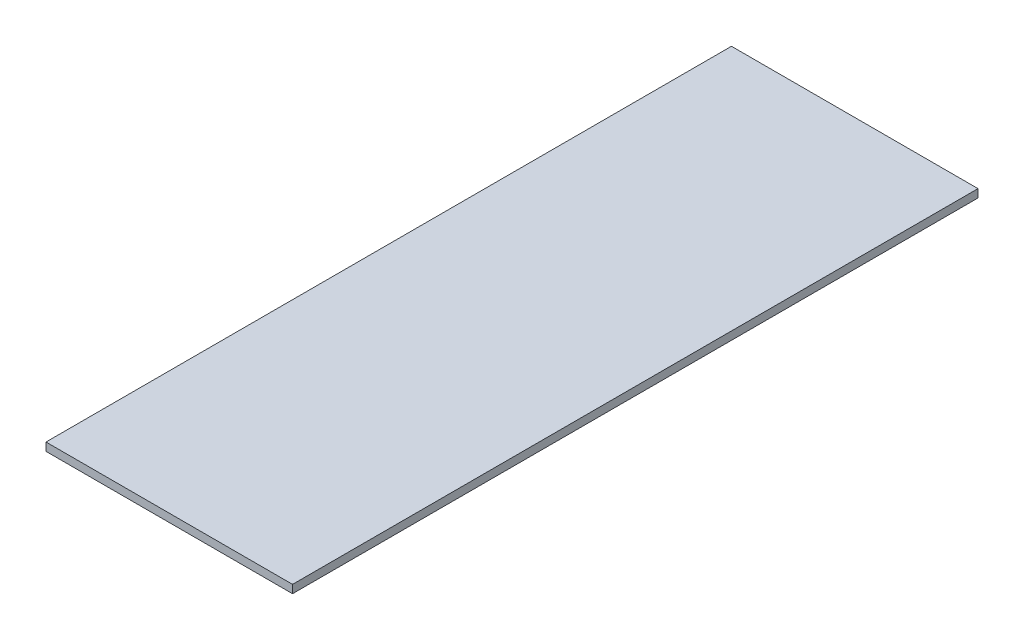
ISO-10303-21;
HEADER;
FILE_DESCRIPTION(('STEP AP214'),'2;1');
FILE_NAME('part.step','',(''),(''),'','','');
FILE_SCHEMA(('AUTOMOTIVE_DESIGN { 1 0 10303 214 1 1 1 1 }'));
ENDSEC;
DATA;
#1=APPLICATION_CONTEXT('core data for automotive mechanical design processes');
#2=APPLICATION_PROTOCOL_DEFINITION('international standard','automotive_design',2000,#1);
#3=PRODUCT_CONTEXT('',#1,'mechanical');
#4=PRODUCT('Part','Part','',(#3));
#5=PRODUCT_RELATED_PRODUCT_CATEGORY('part','',(#4));
#6=PRODUCT_DEFINITION_FORMATION('','',#4);
#7=PRODUCT_DEFINITION_CONTEXT('part definition',#1,'design');
#8=PRODUCT_DEFINITION('design','',#6,#7);
#9=PRODUCT_DEFINITION_SHAPE('','',#8);
#10=(LENGTH_UNIT() NAMED_UNIT(*) SI_UNIT(.MILLI.,.METRE.));
#11=(NAMED_UNIT(*) PLANE_ANGLE_UNIT() SI_UNIT($,.RADIAN.));
#12=(NAMED_UNIT(*) SI_UNIT($,.STERADIAN.) SOLID_ANGLE_UNIT());
#13=UNCERTAINTY_MEASURE_WITH_UNIT(LENGTH_MEASURE(1.E-05),#10,'distance_accuracy_value','');
#14=(GEOMETRIC_REPRESENTATION_CONTEXT(3) GLOBAL_UNCERTAINTY_ASSIGNED_CONTEXT((#13)) GLOBAL_UNIT_ASSIGNED_CONTEXT((#10,
#11,#12)) REPRESENTATION_CONTEXT('',''));
#15=CARTESIAN_POINT('',(0.,0.,0.));
#16=DIRECTION('',(0.,0.,1.));
#17=DIRECTION('',(1.,0.,0.));
#18=AXIS2_PLACEMENT_3D('',#15,#16,#17);
#19=CARTESIAN_POINT('',(-45.5,3.,113.));
#20=DIRECTION('',(1.,0.,0.));
#21=DIRECTION('',(0.,0.,-1.));
#22=AXIS2_PLACEMENT_3D('',#19,#20,#21);
#23=PLANE('',#22);
#24=DIRECTION('',(0.,0.,1.));
#25=VECTOR('',#24,1.);
#26=CARTESIAN_POINT('',(-45.5,0.,113.));
#27=LINE('',#26,#25);
#28=CARTESIAN_POINT('',(-45.5,0.,-113.));
#29=VERTEX_POINT('',#28);
#30=CARTESIAN_POINT('',(-45.5,0.,140.));
#31=VERTEX_POINT('',#30);
#32=EDGE_CURVE('E96',#29,#31,#27,.T.);
#33=ORIENTED_EDGE('',*,*,#32,.T.);
#34=DIRECTION('',(0.,-1.,0.));
#35=VECTOR('',#34,1.);
#36=CARTESIAN_POINT('',(-45.5,3.,140.));
#37=LINE('',#36,#35);
#38=CARTESIAN_POINT('',(-45.5,3.,140.));
#39=VERTEX_POINT('',#38);
#40=EDGE_CURVE('E12',#39,#31,#37,.T.);
#41=ORIENTED_EDGE('',*,*,#40,.F.);
#42=DIRECTION('',(0.,0.,1.));
#43=VECTOR('',#42,1.);
#44=CARTESIAN_POINT('',(-45.5,3.,113.));
#45=LINE('',#44,#43);
#46=CARTESIAN_POINT('',(-45.5,3.,-113.));
#47=VERTEX_POINT('',#46);
#48=EDGE_CURVE('E80',#47,#39,#45,.T.);
#49=ORIENTED_EDGE('',*,*,#48,.F.);
#50=DIRECTION('',(0.,-1.,0.));
#51=VECTOR('',#50,1.);
#52=CARTESIAN_POINT('',(-45.5,3.,-113.));
#53=LINE('',#52,#51);
#54=EDGE_CURVE('E92',#47,#29,#53,.T.);
#55=ORIENTED_EDGE('',*,*,#54,.T.);
#56=EDGE_LOOP('',(#33,#41,#49,#55));
#57=FACE_BOUND('',#56,.T.);
#58=ADVANCED_FACE('F38',(#57),#23,.F.);
#59=CARTESIAN_POINT('',(45.5,3.,140.));
#60=DIRECTION('',(0.,0.,-1.));
#61=DIRECTION('',(-1.,0.,0.));
#62=AXIS2_PLACEMENT_3D('',#59,#60,#61);
#63=PLANE('',#62);
#64=DIRECTION('',(1.,0.,0.));
#65=VECTOR('',#64,1.);
#66=CARTESIAN_POINT('',(45.5,0.,140.));
#67=LINE('',#66,#65);
#68=CARTESIAN_POINT('',(45.5,0.,140.));
#69=VERTEX_POINT('',#68);
#70=EDGE_CURVE('E85',#31,#69,#67,.T.);
#71=ORIENTED_EDGE('',*,*,#70,.T.);
#72=DIRECTION('',(0.,-1.,0.));
#73=VECTOR('',#72,1.);
#74=CARTESIAN_POINT('',(45.5,3.,140.));
#75=LINE('',#74,#73);
#76=CARTESIAN_POINT('',(45.5,3.,140.));
#77=VERTEX_POINT('',#76);
#78=EDGE_CURVE('E42',#77,#69,#75,.T.);
#79=ORIENTED_EDGE('',*,*,#78,.F.);
#80=DIRECTION('',(1.,0.,0.));
#81=VECTOR('',#80,1.);
#82=CARTESIAN_POINT('',(45.5,3.,140.));
#83=LINE('',#82,#81);
#84=EDGE_CURVE('E73',#39,#77,#83,.T.);
#85=ORIENTED_EDGE('',*,*,#84,.F.);
#86=ORIENTED_EDGE('',*,*,#40,.T.);
#87=EDGE_LOOP('',(#71,#79,#85,#86));
#88=FACE_BOUND('',#87,.T.);
#89=ADVANCED_FACE('F40',(#88),#63,.F.);
#90=CARTESIAN_POINT('',(45.5,3.,113.));
#91=DIRECTION('',(-1.,0.,0.));
#92=DIRECTION('',(0.,0.,1.));
#93=AXIS2_PLACEMENT_3D('',#90,#91,#92);
#94=PLANE('',#93);
#95=DIRECTION('',(0.,0.,-1.));
#96=VECTOR('',#95,1.);
#97=CARTESIAN_POINT('',(45.5,0.,113.));
#98=LINE('',#97,#96);
#99=CARTESIAN_POINT('',(45.5,0.,-113.));
#100=VERTEX_POINT('',#99);
#101=EDGE_CURVE('E100',#69,#100,#98,.T.);
#102=ORIENTED_EDGE('',*,*,#101,.T.);
#103=DIRECTION('',(0.,-1.,0.));
#104=VECTOR('',#103,1.);
#105=CARTESIAN_POINT('',(45.5,3.,-113.));
#106=LINE('',#105,#104);
#107=CARTESIAN_POINT('',(45.5,3.,-113.));
#108=VERTEX_POINT('',#107);
#109=EDGE_CURVE('E88',#108,#100,#106,.T.);
#110=ORIENTED_EDGE('',*,*,#109,.F.);
#111=DIRECTION('',(0.,0.,-1.));
#112=VECTOR('',#111,1.);
#113=CARTESIAN_POINT('',(45.5,3.,113.));
#114=LINE('',#113,#112);
#115=EDGE_CURVE('E77',#77,#108,#114,.T.);
#116=ORIENTED_EDGE('',*,*,#115,.F.);
#117=ORIENTED_EDGE('',*,*,#78,.T.);
#118=EDGE_LOOP('',(#102,#110,#116,#117));
#119=FACE_BOUND('',#118,.T.);
#120=ADVANCED_FACE('F89',(#119),#94,.F.);
#121=CARTESIAN_POINT('',(45.5,3.,-113.));
#122=DIRECTION('',(0.,0.,1.));
#123=DIRECTION('',(1.,0.,0.));
#124=AXIS2_PLACEMENT_3D('',#121,#122,#123);
#125=PLANE('',#124);
#126=DIRECTION('',(-1.,0.,0.));
#127=VECTOR('',#126,1.);
#128=CARTESIAN_POINT('',(45.5,0.,-113.));
#129=LINE('',#128,#127);
#130=EDGE_CURVE('E102',#100,#29,#129,.T.);
#131=ORIENTED_EDGE('',*,*,#130,.T.);
#132=ORIENTED_EDGE('',*,*,#54,.F.);
#133=DIRECTION('',(-1.,0.,0.));
#134=VECTOR('',#133,1.);
#135=CARTESIAN_POINT('',(45.5,3.,-113.));
#136=LINE('',#135,#134);
#137=EDGE_CURVE('E56',#108,#47,#136,.T.);
#138=ORIENTED_EDGE('',*,*,#137,.F.);
#139=ORIENTED_EDGE('',*,*,#109,.T.);
#140=EDGE_LOOP('',(#131,#132,#138,#139));
#141=FACE_BOUND('',#140,.T.);
#142=ADVANCED_FACE('F109',(#141),#125,.F.);
#143=CARTESIAN_POINT('',(0.,3.,0.));
#144=DIRECTION('',(0.,1.,0.));
#145=DIRECTION('',(0.,0.,1.));
#146=AXIS2_PLACEMENT_3D('',#143,#144,#145);
#147=PLANE('',#146);
#148=ORIENTED_EDGE('',*,*,#48,.T.);
#149=ORIENTED_EDGE('',*,*,#84,.T.);
#150=ORIENTED_EDGE('',*,*,#115,.T.);
#151=ORIENTED_EDGE('',*,*,#137,.T.);
#152=EDGE_LOOP('',(#148,#149,#150,#151));
#153=FACE_BOUND('',#152,.T.);
#154=ADVANCED_FACE('F75',(#153),#147,.T.);
#155=CARTESIAN_POINT('',(0.,0.,0.));
#156=DIRECTION('',(0.,1.,0.));
#157=DIRECTION('',(0.,0.,1.));
#158=AXIS2_PLACEMENT_3D('',#155,#156,#157);
#159=PLANE('',#158);
#160=ORIENTED_EDGE('',*,*,#32,.F.);
#161=ORIENTED_EDGE('',*,*,#130,.F.);
#162=ORIENTED_EDGE('',*,*,#101,.F.);
#163=ORIENTED_EDGE('',*,*,#70,.F.);
#164=EDGE_LOOP('',(#160,#161,#162,#163));
#165=FACE_BOUND('',#164,.T.);
#166=ADVANCED_FACE('F112',(#165),#159,.F.);
#167=CLOSED_SHELL('',(#58,#89,#120,#142,#154,#166));
#168=MANIFOLD_SOLID_BREP('B2',#167);
#169=ADVANCED_BREP_SHAPE_REPRESENTATION('',(#18,#168),#14);
#170=SHAPE_DEFINITION_REPRESENTATION(#9,#169);
ENDSEC;
END-ISO-10303-21;
